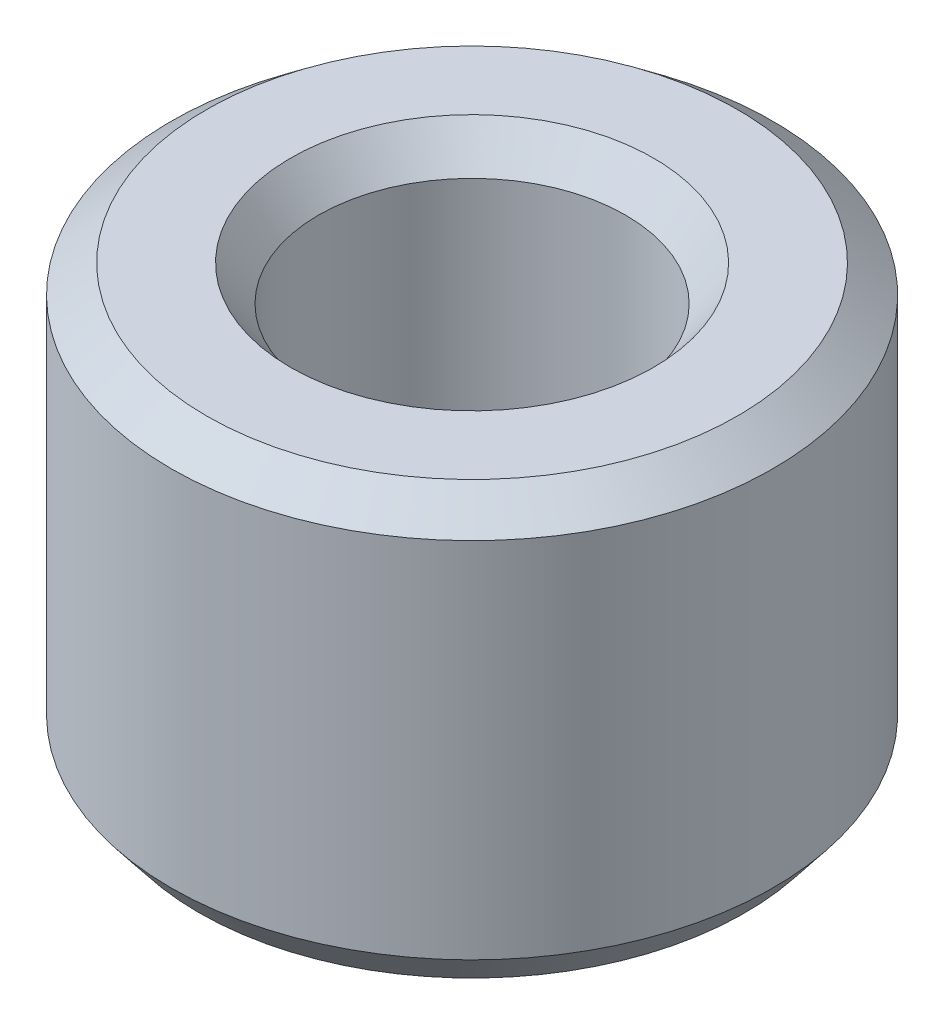
ISO-10303-21;
HEADER;
FILE_DESCRIPTION(('STEP AP214'),'2;1');
FILE_NAME('part.step','',(''),(''),'','','');
FILE_SCHEMA(('AUTOMOTIVE_DESIGN { 1 0 10303 214 1 1 1 1 }'));
ENDSEC;
DATA;
#1=APPLICATION_CONTEXT('core data for automotive mechanical design processes');
#2=APPLICATION_PROTOCOL_DEFINITION('international standard','automotive_design',2000,#1);
#3=PRODUCT_CONTEXT('',#1,'mechanical');
#4=PRODUCT('Part','Part','',(#3));
#5=PRODUCT_RELATED_PRODUCT_CATEGORY('part','',(#4));
#6=PRODUCT_DEFINITION_FORMATION('','',#4);
#7=PRODUCT_DEFINITION_CONTEXT('part definition',#1,'design');
#8=PRODUCT_DEFINITION('design','',#6,#7);
#9=PRODUCT_DEFINITION_SHAPE('','',#8);
#10=(LENGTH_UNIT() NAMED_UNIT(*) SI_UNIT(.MILLI.,.METRE.));
#11=(NAMED_UNIT(*) PLANE_ANGLE_UNIT() SI_UNIT($,.RADIAN.));
#12=(NAMED_UNIT(*) SI_UNIT($,.STERADIAN.) SOLID_ANGLE_UNIT());
#13=UNCERTAINTY_MEASURE_WITH_UNIT(LENGTH_MEASURE(1.E-05),#10,'distance_accuracy_value','');
#14=(GEOMETRIC_REPRESENTATION_CONTEXT(3) GLOBAL_UNCERTAINTY_ASSIGNED_CONTEXT((#13)) GLOBAL_UNIT_ASSIGNED_CONTEXT((#10,
#11,#12)) REPRESENTATION_CONTEXT('',''));
#15=CARTESIAN_POINT('',(0.,0.,0.));
#16=DIRECTION('',(0.,0.,1.));
#17=DIRECTION('',(1.,0.,0.));
#18=AXIS2_PLACEMENT_3D('',#15,#16,#17);
#19=CARTESIAN_POINT('',(0.,42.5115038635486,0.));
#20=DIRECTION('',(0.,-1.,0.));
#21=DIRECTION('',(0.,0.,-1.));
#22=AXIS2_PLACEMENT_3D('',#19,#20,#21);
#23=CYLINDRICAL_SURFACE('',#22,30.);
#24=CARTESIAN_POINT('',(0.,3.5353365614957,0.));
#25=DIRECTION('',(0.,1.,0.));
#26=DIRECTION('',(0.,0.,1.));
#27=AXIS2_PLACEMENT_3D('',#24,#25,#26);
#28=CIRCLE('',#27,30.);
#29=CARTESIAN_POINT('',(0.,3.5353365614957,30.));
#30=VERTEX_POINT('',#29);
#31=EDGE_CURVE('E10',#30,#30,#28,.T.);
#32=ORIENTED_EDGE('',*,*,#31,.T.);
#33=EDGE_LOOP('',(#32));
#34=FACE_BOUND('',#33,.T.);
#35=CARTESIAN_POINT('',(0.,39.7306282153197,0.));
#36=DIRECTION('',(0.,1.,0.));
#37=DIRECTION('',(0.,0.,1.));
#38=AXIS2_PLACEMENT_3D('',#35,#36,#37);
#39=CIRCLE('',#38,30.);
#40=CARTESIAN_POINT('',(0.,39.7306282153197,30.));
#41=VERTEX_POINT('',#40);
#42=EDGE_CURVE('E50',#41,#41,#39,.F.);
#43=ORIENTED_EDGE('',*,*,#42,.T.);
#44=EDGE_LOOP('',(#43));
#45=FACE_BOUND('',#44,.T.);
#46=ADVANCED_FACE('F39',(#34,#45),#23,.T.);
#47=CARTESIAN_POINT('',(0.,42.5115038635486,0.));
#48=DIRECTION('',(0.,1.,0.));
#49=DIRECTION('',(0.,0.,1.));
#50=AXIS2_PLACEMENT_3D('',#47,#48,#49);
#51=PLANE('',#50);
#52=CARTESIAN_POINT('',(0.,42.5115038635486,0.));
#53=DIRECTION('',(0.,1.,0.));
#54=DIRECTION('',(0.,0.,1.));
#55=AXIS2_PLACEMENT_3D('',#52,#53,#54);
#56=CIRCLE('',#55,18.0858234727964);
#57=CARTESIAN_POINT('',(0.,42.5115038635486,18.0858234727964));
#58=VERTEX_POINT('',#57);
#59=EDGE_CURVE('E58',#58,#58,#56,.F.);
#60=ORIENTED_EDGE('',*,*,#59,.T.);
#61=EDGE_LOOP('',(#60));
#62=FACE_BOUND('',#61,.T.);
#63=CARTESIAN_POINT('',(0.,42.5115038635486,0.));
#64=DIRECTION('',(0.,1.,0.));
#65=DIRECTION('',(0.,0.,1.));
#66=AXIS2_PLACEMENT_3D('',#63,#64,#65);
#67=CIRCLE('',#66,26.4646634385043);
#68=CARTESIAN_POINT('',(0.,42.5115038635486,26.4646634385043));
#69=VERTEX_POINT('',#68);
#70=EDGE_CURVE('E61',#69,#69,#67,.T.);
#71=ORIENTED_EDGE('',*,*,#70,.T.);
#72=EDGE_LOOP('',(#71));
#73=FACE_BOUND('',#72,.T.);
#74=ADVANCED_FACE('F88',(#62,#73),#51,.T.);
#75=CARTESIAN_POINT('',(0.,0.,0.));
#76=DIRECTION('',(0.,1.,0.));
#77=DIRECTION('',(0.,0.,1.));
#78=AXIS2_PLACEMENT_3D('',#75,#76,#77);
#79=PLANE('',#78);
#80=CARTESIAN_POINT('',(0.,0.,0.));
#81=DIRECTION('',(0.,1.,0.));
#82=DIRECTION('',(0.,0.,1.));
#83=AXIS2_PLACEMENT_3D('',#80,#81,#82);
#84=CIRCLE('',#83,18.8402843860632);
#85=CARTESIAN_POINT('',(0.,0.,18.8402843860632));
#86=VERTEX_POINT('',#85);
#87=EDGE_CURVE('E51',#86,#86,#84,.T.);
#88=ORIENTED_EDGE('',*,*,#87,.T.);
#89=EDGE_LOOP('',(#88));
#90=FACE_BOUND('',#89,.T.);
#91=CARTESIAN_POINT('',(0.,0.,0.));
#92=DIRECTION('',(0.,1.,0.));
#93=DIRECTION('',(0.,0.,1.));
#94=AXIS2_PLACEMENT_3D('',#91,#92,#93);
#95=CIRCLE('',#94,27.2191243517711);
#96=CARTESIAN_POINT('',(0.,0.,27.2191243517711));
#97=VERTEX_POINT('',#96);
#98=EDGE_CURVE('E54',#97,#97,#95,.F.);
#99=ORIENTED_EDGE('',*,*,#98,.T.);
#100=EDGE_LOOP('',(#99));
#101=FACE_BOUND('',#100,.T.);
#102=ADVANCED_FACE('F83',(#90,#101),#79,.F.);
#103=CARTESIAN_POINT('',(0.,42.5115038635486,0.));
#104=DIRECTION('',(0.,-1.,0.));
#105=DIRECTION('',(0.,0.,-1.));
#106=AXIS2_PLACEMENT_3D('',#103,#104,#105);
#107=CYLINDRICAL_SURFACE('',#106,15.3049478245675);
#108=CARTESIAN_POINT('',(0.,38.9761673020529,0.));
#109=DIRECTION('',(0.,1.,0.));
#110=DIRECTION('',(0.,0.,1.));
#111=AXIS2_PLACEMENT_3D('',#108,#109,#110);
#112=CIRCLE('',#111,15.3049478245675);
#113=CARTESIAN_POINT('',(0.,38.9761673020529,15.3049478245675));
#114=VERTEX_POINT('',#113);
#115=EDGE_CURVE('E67',#114,#114,#112,.T.);
#116=ORIENTED_EDGE('',*,*,#115,.T.);
#117=EDGE_LOOP('',(#116));
#118=FACE_BOUND('',#117,.T.);
#119=CARTESIAN_POINT('',(0.,2.78087564822891,0.));
#120=DIRECTION('',(0.,1.,0.));
#121=DIRECTION('',(0.,0.,1.));
#122=AXIS2_PLACEMENT_3D('',#119,#120,#121);
#123=CIRCLE('',#122,15.3049478245675);
#124=CARTESIAN_POINT('',(0.,2.78087564822891,15.3049478245675));
#125=VERTEX_POINT('',#124);
#126=EDGE_CURVE('E69',#125,#125,#123,.F.);
#127=ORIENTED_EDGE('',*,*,#126,.T.);
#128=EDGE_LOOP('',(#127));
#129=FACE_BOUND('',#128,.T.);
#130=ADVANCED_FACE('F71',(#118,#129),#107,.F.);
#131=CARTESIAN_POINT('',(0.,38.9761673020529,0.));
#132=DIRECTION('',(0.,1.,0.));
#133=DIRECTION('',(0.,0.,1.));
#134=AXIS2_PLACEMENT_3D('',#131,#132,#133);
#135=CONICAL_SURFACE('',#134,15.3049478245675,0.666513125139016);
#136=ORIENTED_EDGE('',*,*,#59,.F.);
#137=EDGE_LOOP('',(#136));
#138=FACE_BOUND('',#137,.T.);
#139=ORIENTED_EDGE('',*,*,#115,.F.);
#140=EDGE_LOOP('',(#139));
#141=FACE_BOUND('',#140,.T.);
#142=ADVANCED_FACE('F77',(#138,#141),#135,.F.);
#143=CARTESIAN_POINT('',(0.,0.,0.));
#144=DIRECTION('',(0.,-1.,0.));
#145=DIRECTION('',(0.,0.,-1.));
#146=AXIS2_PLACEMENT_3D('',#143,#144,#145);
#147=CONICAL_SURFACE('',#146,18.8402843860632,0.904283201655878);
#148=ORIENTED_EDGE('',*,*,#126,.F.);
#149=EDGE_LOOP('',(#148));
#150=FACE_BOUND('',#149,.T.);
#151=ORIENTED_EDGE('',*,*,#87,.F.);
#152=EDGE_LOOP('',(#151));
#153=FACE_BOUND('',#152,.T.);
#154=ADVANCED_FACE('F73',(#150,#153),#147,.F.);
#155=CARTESIAN_POINT('',(0.,3.5353365614957,0.));
#156=DIRECTION('',(0.,1.,0.));
#157=DIRECTION('',(0.,0.,1.));
#158=AXIS2_PLACEMENT_3D('',#155,#156,#157);
#159=CONICAL_SURFACE('',#158,30.,0.666513125139017);
#160=ORIENTED_EDGE('',*,*,#98,.F.);
#161=EDGE_LOOP('',(#160));
#162=FACE_BOUND('',#161,.T.);
#163=ORIENTED_EDGE('',*,*,#31,.F.);
#164=EDGE_LOOP('',(#163));
#165=FACE_BOUND('',#164,.T.);
#166=ADVANCED_FACE('F76',(#162,#165),#159,.T.);
#167=CARTESIAN_POINT('',(0.,42.5115038635486,0.));
#168=DIRECTION('',(0.,-1.,0.));
#169=DIRECTION('',(0.,0.,-1.));
#170=AXIS2_PLACEMENT_3D('',#167,#168,#169);
#171=CONICAL_SURFACE('',#170,26.4646634385043,0.904283201655878);
#172=ORIENTED_EDGE('',*,*,#42,.F.);
#173=EDGE_LOOP('',(#172));
#174=FACE_BOUND('',#173,.T.);
#175=ORIENTED_EDGE('',*,*,#70,.F.);
#176=EDGE_LOOP('',(#175));
#177=FACE_BOUND('',#176,.T.);
#178=ADVANCED_FACE('F45',(#174,#177),#171,.T.);
#179=CLOSED_SHELL('',(#46,#74,#102,#130,#142,#154,#166,#178));
#180=MANIFOLD_SOLID_BREP('B2',#179);
#181=ADVANCED_BREP_SHAPE_REPRESENTATION('',(#18,#180),#14);
#182=SHAPE_DEFINITION_REPRESENTATION(#9,#181);
ENDSEC;
END-ISO-10303-21;
